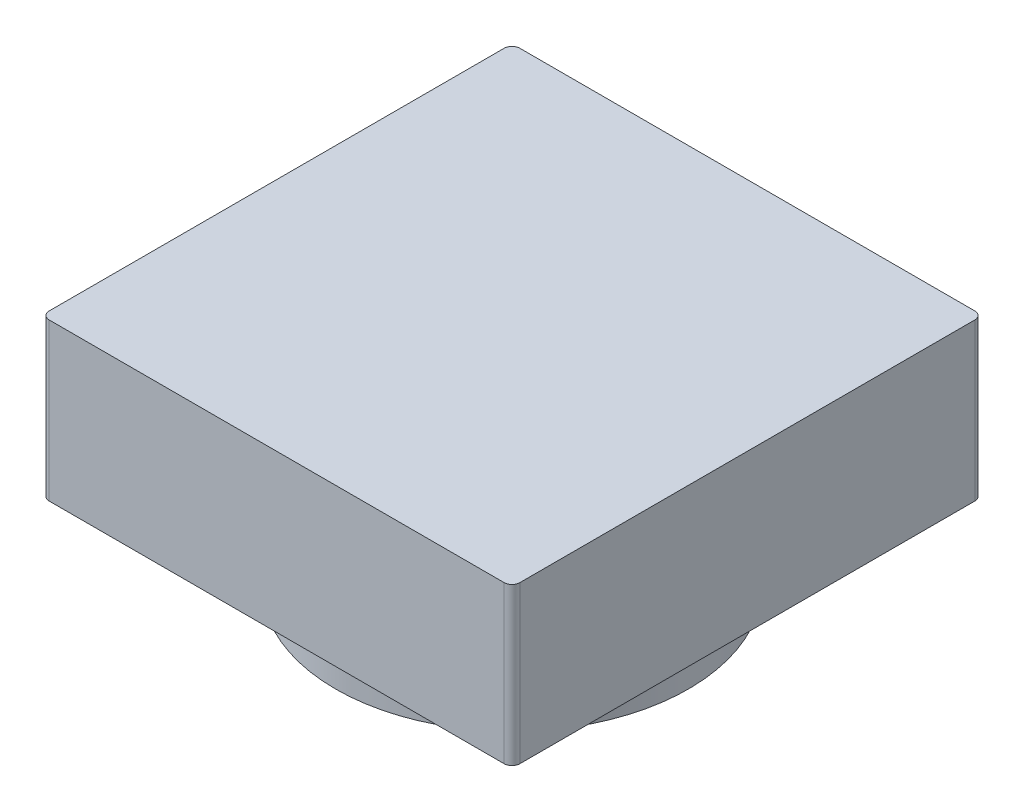
ISO-10303-21;
HEADER;
FILE_DESCRIPTION(('STEP AP214'),'2;1');
FILE_NAME('part.step','',(''),(''),'','','');
FILE_SCHEMA(('AUTOMOTIVE_DESIGN { 1 0 10303 214 1 1 1 1 }'));
ENDSEC;
DATA;
#1=APPLICATION_CONTEXT('core data for automotive mechanical design processes');
#2=APPLICATION_PROTOCOL_DEFINITION('international standard','automotive_design',2000,#1);
#3=PRODUCT_CONTEXT('',#1,'mechanical');
#4=PRODUCT('Part','Part','',(#3));
#5=PRODUCT_RELATED_PRODUCT_CATEGORY('part','',(#4));
#6=PRODUCT_DEFINITION_FORMATION('','',#4);
#7=PRODUCT_DEFINITION_CONTEXT('part definition',#1,'design');
#8=PRODUCT_DEFINITION('design','',#6,#7);
#9=PRODUCT_DEFINITION_SHAPE('','',#8);
#10=(LENGTH_UNIT() NAMED_UNIT(*) SI_UNIT(.MILLI.,.METRE.));
#11=(NAMED_UNIT(*) PLANE_ANGLE_UNIT() SI_UNIT($,.RADIAN.));
#12=(NAMED_UNIT(*) SI_UNIT($,.STERADIAN.) SOLID_ANGLE_UNIT());
#13=UNCERTAINTY_MEASURE_WITH_UNIT(LENGTH_MEASURE(1.E-05),#10,'distance_accuracy_value','');
#14=(GEOMETRIC_REPRESENTATION_CONTEXT(3) GLOBAL_UNCERTAINTY_ASSIGNED_CONTEXT((#13)) GLOBAL_UNIT_ASSIGNED_CONTEXT((#10,
#11,#12)) REPRESENTATION_CONTEXT('',''));
#15=CARTESIAN_POINT('',(0.,0.,0.));
#16=DIRECTION('',(0.,0.,1.));
#17=DIRECTION('',(1.,0.,0.));
#18=AXIS2_PLACEMENT_3D('',#15,#16,#17);
#19=CARTESIAN_POINT('',(0.,10.,0.));
#20=DIRECTION('',(0.,-1.,0.));
#21=DIRECTION('',(0.,0.,-1.));
#22=AXIS2_PLACEMENT_3D('',#19,#20,#21);
#23=CYLINDRICAL_SURFACE('',#22,22.5);
#24=CARTESIAN_POINT('',(0.,10.,0.));
#25=DIRECTION('',(0.,1.,0.));
#26=DIRECTION('',(0.,0.,1.));
#27=AXIS2_PLACEMENT_3D('',#24,#25,#26);
#28=CIRCLE('',#27,22.5);
#29=CARTESIAN_POINT('',(0.,10.,22.5));
#30=VERTEX_POINT('',#29);
#31=EDGE_CURVE('E11',#30,#30,#28,.T.);
#32=ORIENTED_EDGE('',*,*,#31,.F.);
#33=EDGE_LOOP('',(#32));
#34=FACE_BOUND('',#33,.T.);
#35=CARTESIAN_POINT('',(0.,0.,0.));
#36=DIRECTION('',(0.,1.,0.));
#37=DIRECTION('',(0.,0.,1.));
#38=AXIS2_PLACEMENT_3D('',#35,#36,#37);
#39=CIRCLE('',#38,22.5);
#40=CARTESIAN_POINT('',(0.,0.,22.5));
#41=VERTEX_POINT('',#40);
#42=EDGE_CURVE('E42',#41,#41,#39,.T.);
#43=ORIENTED_EDGE('',*,*,#42,.T.);
#44=EDGE_LOOP('',(#43));
#45=FACE_BOUND('',#44,.T.);
#46=ADVANCED_FACE('F39',(#34,#45),#23,.T.);
#47=CARTESIAN_POINT('',(0.,0.,0.));
#48=DIRECTION('',(0.,1.,0.));
#49=DIRECTION('',(0.,0.,1.));
#50=AXIS2_PLACEMENT_3D('',#47,#48,#49);
#51=PLANE('',#50);
#52=CARTESIAN_POINT('',(0.,0.,0.));
#53=DIRECTION('',(0.,-1.,0.));
#54=DIRECTION('',(0.,0.,-1.));
#55=AXIS2_PLACEMENT_3D('',#52,#53,#54);
#56=CIRCLE('',#55,21.5);
#57=CARTESIAN_POINT('',(4.83856503950974,0.,20.9484674465326));
#58=VERTEX_POINT('',#57);
#59=CARTESIAN_POINT('',(-4.83856503950294,0.,20.9484674465341));
#60=VERTEX_POINT('',#59);
#61=EDGE_CURVE('E269',#58,#60,#56,.T.);
#62=ORIENTED_EDGE('',*,*,#61,.F.);
#63=DIRECTION('',(-0.471428571428459,0.,0.881904247660097));
#64=VECTOR('',#63,1.);
#65=CARTESIAN_POINT('',(12.4726457883362,0.,6.66734693877418));
#66=LINE('',#65,#64);
#67=CARTESIAN_POINT('',(14.5514200863916,0.,2.77857142856957));
#68=VERTEX_POINT('',#67);
#69=EDGE_CURVE('E53',#68,#58,#66,.T.);
#70=ORIENTED_EDGE('',*,*,#69,.F.);
#71=CARTESIAN_POINT('',(0.,0.,-5.));
#72=DIRECTION('',(0.,-1.,0.));
#73=DIRECTION('',(0.,0.,-1.));
#74=AXIS2_PLACEMENT_3D('',#71,#72,#73);
#75=CIRCLE('',#74,16.5);
#76=CARTESIAN_POINT('',(-14.5514200863896,0.,2.77857142857328));
#77=VERTEX_POINT('',#76);
#78=EDGE_CURVE('E257',#77,#68,#75,.T.);
#79=ORIENTED_EDGE('',*,*,#78,.F.);
#80=DIRECTION('',(-0.471428571428684,0.,-0.881904247659977));
#81=VECTOR('',#80,1.);
#82=CARTESIAN_POINT('',(-12.4726457883335,0.,6.66734693877684));
#83=LINE('',#82,#81);
#84=EDGE_CURVE('E262',#60,#77,#83,.T.);
#85=ORIENTED_EDGE('',*,*,#84,.F.);
#86=EDGE_LOOP('',(#62,#70,#79,#85));
#87=FACE_BOUND('',#86,.T.);
#88=ORIENTED_EDGE('',*,*,#42,.F.);
#89=EDGE_LOOP('',(#88));
#90=FACE_BOUND('',#89,.T.);
#91=ADVANCED_FACE('F183',(#87,#90),#51,.F.);
#92=CARTESIAN_POINT('',(-29.,30.,29.));
#93=DIRECTION('',(0.,-1.,0.));
#94=DIRECTION('',(0.,0.,-1.));
#95=AXIS2_PLACEMENT_3D('',#92,#93,#94);
#96=CYLINDRICAL_SURFACE('',#95,1.);
#97=CARTESIAN_POINT('',(-29.,10.,29.));
#98=DIRECTION('',(0.,1.,0.));
#99=DIRECTION('',(0.,0.,1.));
#100=AXIS2_PLACEMENT_3D('',#97,#98,#99);
#101=CIRCLE('',#100,1.);
#102=CARTESIAN_POINT('',(-30.,10.,29.));
#103=VERTEX_POINT('',#102);
#104=CARTESIAN_POINT('',(-29.,10.,30.));
#105=VERTEX_POINT('',#104);
#106=EDGE_CURVE('E148',#103,#105,#101,.T.);
#107=ORIENTED_EDGE('',*,*,#106,.T.);
#108=DIRECTION('',(0.,-1.,0.));
#109=VECTOR('',#108,1.);
#110=CARTESIAN_POINT('',(-29.,30.,30.));
#111=LINE('',#110,#109);
#112=CARTESIAN_POINT('',(-29.,30.,30.));
#113=VERTEX_POINT('',#112);
#114=EDGE_CURVE('E177',#113,#105,#111,.T.);
#115=ORIENTED_EDGE('',*,*,#114,.F.);
#116=CARTESIAN_POINT('',(-29.,30.,29.));
#117=DIRECTION('',(0.,1.,0.));
#118=DIRECTION('',(0.,0.,1.));
#119=AXIS2_PLACEMENT_3D('',#116,#117,#118);
#120=CIRCLE('',#119,1.);
#121=CARTESIAN_POINT('',(-30.,30.,29.));
#122=VERTEX_POINT('',#121);
#123=EDGE_CURVE('E164',#122,#113,#120,.T.);
#124=ORIENTED_EDGE('',*,*,#123,.F.);
#125=DIRECTION('',(0.,-1.,0.));
#126=VECTOR('',#125,1.);
#127=CARTESIAN_POINT('',(-30.,30.,29.));
#128=LINE('',#127,#126);
#129=EDGE_CURVE('E144',#122,#103,#128,.T.);
#130=ORIENTED_EDGE('',*,*,#129,.T.);
#131=EDGE_LOOP('',(#107,#115,#124,#130));
#132=FACE_BOUND('',#131,.T.);
#133=ADVANCED_FACE('F185',(#132),#96,.T.);
#134=CARTESIAN_POINT('',(-29.,30.,30.));
#135=DIRECTION('',(0.,0.,-1.));
#136=DIRECTION('',(-1.,0.,0.));
#137=AXIS2_PLACEMENT_3D('',#134,#135,#136);
#138=PLANE('',#137);
#139=DIRECTION('',(1.,0.,0.));
#140=VECTOR('',#139,1.);
#141=CARTESIAN_POINT('',(-29.,10.,30.));
#142=LINE('',#141,#140);
#143=CARTESIAN_POINT('',(29.,10.,30.));
#144=VERTEX_POINT('',#143);
#145=EDGE_CURVE('E151',#105,#144,#142,.T.);
#146=ORIENTED_EDGE('',*,*,#145,.T.);
#147=DIRECTION('',(0.,-1.,0.));
#148=VECTOR('',#147,1.);
#149=CARTESIAN_POINT('',(29.,30.,30.));
#150=LINE('',#149,#148);
#151=CARTESIAN_POINT('',(29.,30.,30.));
#152=VERTEX_POINT('',#151);
#153=EDGE_CURVE('E174',#152,#144,#150,.T.);
#154=ORIENTED_EDGE('',*,*,#153,.F.);
#155=DIRECTION('',(1.,0.,0.));
#156=VECTOR('',#155,1.);
#157=CARTESIAN_POINT('',(-29.,30.,30.));
#158=LINE('',#157,#156);
#159=EDGE_CURVE('E104',#113,#152,#158,.T.);
#160=ORIENTED_EDGE('',*,*,#159,.F.);
#161=ORIENTED_EDGE('',*,*,#114,.T.);
#162=EDGE_LOOP('',(#146,#154,#160,#161));
#163=FACE_BOUND('',#162,.T.);
#164=ADVANCED_FACE('F192',(#163),#138,.F.);
#165=CARTESIAN_POINT('',(29.,30.,29.));
#166=DIRECTION('',(0.,-1.,0.));
#167=DIRECTION('',(0.,0.,-1.));
#168=AXIS2_PLACEMENT_3D('',#165,#166,#167);
#169=CYLINDRICAL_SURFACE('',#168,1.);
#170=CARTESIAN_POINT('',(29.,10.,29.));
#171=DIRECTION('',(0.,1.,0.));
#172=DIRECTION('',(0.,0.,1.));
#173=AXIS2_PLACEMENT_3D('',#170,#171,#172);
#174=CIRCLE('',#173,1.);
#175=CARTESIAN_POINT('',(30.,10.,29.));
#176=VERTEX_POINT('',#175);
#177=EDGE_CURVE('E154',#144,#176,#174,.T.);
#178=ORIENTED_EDGE('',*,*,#177,.T.);
#179=DIRECTION('',(0.,-1.,0.));
#180=VECTOR('',#179,1.);
#181=CARTESIAN_POINT('',(30.,30.,29.));
#182=LINE('',#181,#180);
#183=CARTESIAN_POINT('',(30.,30.,29.));
#184=VERTEX_POINT('',#183);
#185=EDGE_CURVE('E171',#184,#176,#182,.T.);
#186=ORIENTED_EDGE('',*,*,#185,.F.);
#187=CARTESIAN_POINT('',(29.,30.,29.));
#188=DIRECTION('',(0.,1.,0.));
#189=DIRECTION('',(0.,0.,1.));
#190=AXIS2_PLACEMENT_3D('',#187,#188,#189);
#191=CIRCLE('',#190,1.);
#192=EDGE_CURVE('E284',#152,#184,#191,.T.);
#193=ORIENTED_EDGE('',*,*,#192,.F.);
#194=ORIENTED_EDGE('',*,*,#153,.T.);
#195=EDGE_LOOP('',(#178,#186,#193,#194));
#196=FACE_BOUND('',#195,.T.);
#197=ADVANCED_FACE('F201',(#196),#169,.T.);
#198=CARTESIAN_POINT('',(30.,30.,-29.));
#199=DIRECTION('',(-1.,0.,0.));
#200=DIRECTION('',(0.,0.,1.));
#201=AXIS2_PLACEMENT_3D('',#198,#199,#200);
#202=PLANE('',#201);
#203=DIRECTION('',(0.,0.,-1.));
#204=VECTOR('',#203,1.);
#205=CARTESIAN_POINT('',(30.,10.,-29.));
#206=LINE('',#205,#204);
#207=CARTESIAN_POINT('',(30.,10.,-29.));
#208=VERTEX_POINT('',#207);
#209=EDGE_CURVE('E156',#176,#208,#206,.T.);
#210=ORIENTED_EDGE('',*,*,#209,.T.);
#211=DIRECTION('',(0.,-1.,0.));
#212=VECTOR('',#211,1.);
#213=CARTESIAN_POINT('',(30.,30.,-29.));
#214=LINE('',#213,#212);
#215=CARTESIAN_POINT('',(30.,30.,-29.));
#216=VERTEX_POINT('',#215);
#217=EDGE_CURVE('E168',#216,#208,#214,.T.);
#218=ORIENTED_EDGE('',*,*,#217,.F.);
#219=DIRECTION('',(0.,0.,-1.));
#220=VECTOR('',#219,1.);
#221=CARTESIAN_POINT('',(30.,30.,-29.));
#222=LINE('',#221,#220);
#223=EDGE_CURVE('E286',#184,#216,#222,.T.);
#224=ORIENTED_EDGE('',*,*,#223,.F.);
#225=ORIENTED_EDGE('',*,*,#185,.T.);
#226=EDGE_LOOP('',(#210,#218,#224,#225));
#227=FACE_BOUND('',#226,.T.);
#228=ADVANCED_FACE('F204',(#227),#202,.F.);
#229=CARTESIAN_POINT('',(29.,30.,-29.));
#230=DIRECTION('',(0.,-1.,0.));
#231=DIRECTION('',(0.,0.,-1.));
#232=AXIS2_PLACEMENT_3D('',#229,#230,#231);
#233=CYLINDRICAL_SURFACE('',#232,1.);
#234=CARTESIAN_POINT('',(29.,10.,-29.));
#235=DIRECTION('',(0.,1.,0.));
#236=DIRECTION('',(0.,0.,-1.));
#237=AXIS2_PLACEMENT_3D('',#234,#235,#236);
#238=CIRCLE('',#237,1.);
#239=CARTESIAN_POINT('',(29.,10.,-30.));
#240=VERTEX_POINT('',#239);
#241=EDGE_CURVE('E158',#208,#240,#238,.T.);
#242=ORIENTED_EDGE('',*,*,#241,.T.);
#243=DIRECTION('',(0.,-1.,0.));
#244=VECTOR('',#243,1.);
#245=CARTESIAN_POINT('',(29.,30.,-30.));
#246=LINE('',#245,#244);
#247=CARTESIAN_POINT('',(29.,30.,-30.));
#248=VERTEX_POINT('',#247);
#249=EDGE_CURVE('E139',#248,#240,#246,.T.);
#250=ORIENTED_EDGE('',*,*,#249,.F.);
#251=CARTESIAN_POINT('',(29.,30.,-29.));
#252=DIRECTION('',(0.,1.,0.));
#253=DIRECTION('',(0.,0.,-1.));
#254=AXIS2_PLACEMENT_3D('',#251,#252,#253);
#255=CIRCLE('',#254,1.);
#256=EDGE_CURVE('E127',#216,#248,#255,.T.);
#257=ORIENTED_EDGE('',*,*,#256,.F.);
#258=ORIENTED_EDGE('',*,*,#217,.T.);
#259=EDGE_LOOP('',(#242,#250,#257,#258));
#260=FACE_BOUND('',#259,.T.);
#261=ADVANCED_FACE('F208',(#260),#233,.T.);
#262=CARTESIAN_POINT('',(-29.,30.,-30.));
#263=DIRECTION('',(0.,0.,1.));
#264=DIRECTION('',(1.,0.,0.));
#265=AXIS2_PLACEMENT_3D('',#262,#263,#264);
#266=PLANE('',#265);
#267=DIRECTION('',(-1.,0.,0.));
#268=VECTOR('',#267,1.);
#269=CARTESIAN_POINT('',(-29.,10.,-30.));
#270=LINE('',#269,#268);
#271=CARTESIAN_POINT('',(-29.,10.,-30.));
#272=VERTEX_POINT('',#271);
#273=EDGE_CURVE('E136',#240,#272,#270,.T.);
#274=ORIENTED_EDGE('',*,*,#273,.T.);
#275=DIRECTION('',(0.,-1.,0.));
#276=VECTOR('',#275,1.);
#277=CARTESIAN_POINT('',(-29.,30.,-30.));
#278=LINE('',#277,#276);
#279=CARTESIAN_POINT('',(-29.,30.,-30.));
#280=VERTEX_POINT('',#279);
#281=EDGE_CURVE('E133',#280,#272,#278,.T.);
#282=ORIENTED_EDGE('',*,*,#281,.F.);
#283=DIRECTION('',(-1.,0.,0.));
#284=VECTOR('',#283,1.);
#285=CARTESIAN_POINT('',(-29.,30.,-30.));
#286=LINE('',#285,#284);
#287=EDGE_CURVE('E120',#248,#280,#286,.T.);
#288=ORIENTED_EDGE('',*,*,#287,.F.);
#289=ORIENTED_EDGE('',*,*,#249,.T.);
#290=EDGE_LOOP('',(#274,#282,#288,#289));
#291=FACE_BOUND('',#290,.T.);
#292=ADVANCED_FACE('F134',(#291),#266,.F.);
#293=CARTESIAN_POINT('',(-29.,30.,-29.));
#294=DIRECTION('',(0.,-1.,0.));
#295=DIRECTION('',(0.,0.,-1.));
#296=AXIS2_PLACEMENT_3D('',#293,#294,#295);
#297=CYLINDRICAL_SURFACE('',#296,1.);
#298=CARTESIAN_POINT('',(-29.,10.,-29.));
#299=DIRECTION('',(0.,1.,0.));
#300=DIRECTION('',(0.,0.,1.));
#301=AXIS2_PLACEMENT_3D('',#298,#299,#300);
#302=CIRCLE('',#301,1.);
#303=CARTESIAN_POINT('',(-30.,10.,-29.));
#304=VERTEX_POINT('',#303);
#305=EDGE_CURVE('E161',#272,#304,#302,.T.);
#306=ORIENTED_EDGE('',*,*,#305,.T.);
#307=DIRECTION('',(0.,-1.,0.));
#308=VECTOR('',#307,1.);
#309=CARTESIAN_POINT('',(-30.,30.,-29.));
#310=LINE('',#309,#308);
#311=CARTESIAN_POINT('',(-30.,30.,-29.));
#312=VERTEX_POINT('',#311);
#313=EDGE_CURVE('E140',#312,#304,#310,.T.);
#314=ORIENTED_EDGE('',*,*,#313,.F.);
#315=CARTESIAN_POINT('',(-29.,30.,-29.));
#316=DIRECTION('',(0.,1.,0.));
#317=DIRECTION('',(0.,0.,1.));
#318=AXIS2_PLACEMENT_3D('',#315,#316,#317);
#319=CIRCLE('',#318,1.);
#320=EDGE_CURVE('E124',#280,#312,#319,.T.);
#321=ORIENTED_EDGE('',*,*,#320,.F.);
#322=ORIENTED_EDGE('',*,*,#281,.T.);
#323=EDGE_LOOP('',(#306,#314,#321,#322));
#324=FACE_BOUND('',#323,.T.);
#325=ADVANCED_FACE('F142',(#324),#297,.T.);
#326=CARTESIAN_POINT('',(-30.,30.,-29.));
#327=DIRECTION('',(1.,0.,0.));
#328=DIRECTION('',(0.,0.,-1.));
#329=AXIS2_PLACEMENT_3D('',#326,#327,#328);
#330=PLANE('',#329);
#331=DIRECTION('',(0.,0.,1.));
#332=VECTOR('',#331,1.);
#333=CARTESIAN_POINT('',(-30.,10.,-29.));
#334=LINE('',#333,#332);
#335=EDGE_CURVE('E95',#304,#103,#334,.T.);
#336=ORIENTED_EDGE('',*,*,#335,.T.);
#337=ORIENTED_EDGE('',*,*,#129,.F.);
#338=DIRECTION('',(0.,0.,1.));
#339=VECTOR('',#338,1.);
#340=CARTESIAN_POINT('',(-30.,30.,-29.));
#341=LINE('',#340,#339);
#342=EDGE_CURVE('E62',#312,#122,#341,.T.);
#343=ORIENTED_EDGE('',*,*,#342,.F.);
#344=ORIENTED_EDGE('',*,*,#313,.T.);
#345=EDGE_LOOP('',(#336,#337,#343,#344));
#346=FACE_BOUND('',#345,.T.);
#347=ADVANCED_FACE('F217',(#346),#330,.F.);
#348=CARTESIAN_POINT('',(-29.,30.,29.));
#349=DIRECTION('',(0.,1.,0.));
#350=DIRECTION('',(0.,0.,1.));
#351=AXIS2_PLACEMENT_3D('',#348,#349,#350);
#352=PLANE('',#351);
#353=ORIENTED_EDGE('',*,*,#123,.T.);
#354=ORIENTED_EDGE('',*,*,#159,.T.);
#355=ORIENTED_EDGE('',*,*,#192,.T.);
#356=ORIENTED_EDGE('',*,*,#223,.T.);
#357=ORIENTED_EDGE('',*,*,#256,.T.);
#358=ORIENTED_EDGE('',*,*,#287,.T.);
#359=ORIENTED_EDGE('',*,*,#320,.T.);
#360=ORIENTED_EDGE('',*,*,#342,.T.);
#361=EDGE_LOOP('',(#353,#354,#355,#356,#357,#358,#359,#360));
#362=FACE_BOUND('',#361,.T.);
#363=ADVANCED_FACE('F122',(#362),#352,.T.);
#364=CARTESIAN_POINT('',(-29.,10.,29.));
#365=DIRECTION('',(0.,1.,0.));
#366=DIRECTION('',(0.,0.,1.));
#367=AXIS2_PLACEMENT_3D('',#364,#365,#366);
#368=PLANE('',#367);
#369=ORIENTED_EDGE('',*,*,#31,.T.);
#370=EDGE_LOOP('',(#369));
#371=FACE_BOUND('',#370,.T.);
#372=ORIENTED_EDGE('',*,*,#106,.F.);
#373=ORIENTED_EDGE('',*,*,#335,.F.);
#374=ORIENTED_EDGE('',*,*,#305,.F.);
#375=ORIENTED_EDGE('',*,*,#273,.F.);
#376=ORIENTED_EDGE('',*,*,#241,.F.);
#377=ORIENTED_EDGE('',*,*,#209,.F.);
#378=ORIENTED_EDGE('',*,*,#177,.F.);
#379=ORIENTED_EDGE('',*,*,#145,.F.);
#380=EDGE_LOOP('',(#372,#373,#374,#375,#376,#377,#378,#379));
#381=FACE_BOUND('',#380,.T.);
#382=ADVANCED_FACE('F220',(#371,#381),#368,.F.);
#383=CARTESIAN_POINT('',(12.4726457883362,5.,6.66734693877418));
#384=DIRECTION('',(0.881904247660097,0.,0.471428571428459));
#385=DIRECTION('',(0.471428571428459,0.,-0.881904247660097));
#386=AXIS2_PLACEMENT_3D('',#383,#384,#385);
#387=PLANE('',#386);
#388=ORIENTED_EDGE('',*,*,#69,.T.);
#389=DIRECTION('',(0.,-1.,0.));
#390=VECTOR('',#389,1.);
#391=CARTESIAN_POINT('',(4.83856503950974,5.,20.9484674465326));
#392=LINE('',#391,#390);
#393=CARTESIAN_POINT('',(4.83856503950974,5.,20.9484674465326));
#394=VERTEX_POINT('',#393);
#395=EDGE_CURVE('E267',#394,#58,#392,.T.);
#396=ORIENTED_EDGE('',*,*,#395,.F.);
#397=DIRECTION('',(-0.471428571428459,0.,0.881904247660097));
#398=VECTOR('',#397,1.);
#399=CARTESIAN_POINT('',(12.4726457883362,5.,6.66734693877418));
#400=LINE('',#399,#398);
#401=CARTESIAN_POINT('',(14.5514200863916,5.,2.77857142856957));
#402=VERTEX_POINT('',#401);
#403=EDGE_CURVE('E249',#402,#394,#400,.T.);
#404=ORIENTED_EDGE('',*,*,#403,.F.);
#405=DIRECTION('',(0.,-1.,0.));
#406=VECTOR('',#405,1.);
#407=CARTESIAN_POINT('',(14.5514200863916,5.,2.77857142856957));
#408=LINE('',#407,#406);
#409=EDGE_CURVE('E152',#402,#68,#408,.T.);
#410=ORIENTED_EDGE('',*,*,#409,.T.);
#411=EDGE_LOOP('',(#388,#396,#404,#410));
#412=FACE_BOUND('',#411,.T.);
#413=ADVANCED_FACE('F222',(#412),#387,.F.);
#414=CARTESIAN_POINT('',(0.,5.,-5.));
#415=DIRECTION('',(0.,-1.,0.));
#416=DIRECTION('',(0.,0.,-1.));
#417=AXIS2_PLACEMENT_3D('',#414,#415,#416);
#418=CYLINDRICAL_SURFACE('',#417,16.5);
#419=ORIENTED_EDGE('',*,*,#78,.T.);
#420=ORIENTED_EDGE('',*,*,#409,.F.);
#421=CARTESIAN_POINT('',(0.,5.,-5.));
#422=DIRECTION('',(0.,-1.,0.));
#423=DIRECTION('',(0.,0.,-1.));
#424=AXIS2_PLACEMENT_3D('',#421,#422,#423);
#425=CIRCLE('',#424,16.5);
#426=CARTESIAN_POINT('',(-14.5514200863896,5.,2.77857142857328));
#427=VERTEX_POINT('',#426);
#428=EDGE_CURVE('E255',#427,#402,#425,.T.);
#429=ORIENTED_EDGE('',*,*,#428,.F.);
#430=DIRECTION('',(0.,-1.,0.));
#431=VECTOR('',#430,1.);
#432=CARTESIAN_POINT('',(-14.5514200863896,5.,2.77857142857328));
#433=LINE('',#432,#431);
#434=EDGE_CURVE('E275',#427,#77,#433,.T.);
#435=ORIENTED_EDGE('',*,*,#434,.T.);
#436=EDGE_LOOP('',(#419,#420,#429,#435));
#437=FACE_BOUND('',#436,.T.);
#438=ADVANCED_FACE('F227',(#437),#418,.F.);
#439=CARTESIAN_POINT('',(-12.4726457883335,5.,6.66734693877684));
#440=DIRECTION('',(-0.881904247659977,0.,0.471428571428684));
#441=DIRECTION('',(0.471428571428684,0.,0.881904247659977));
#442=AXIS2_PLACEMENT_3D('',#439,#440,#441);
#443=PLANE('',#442);
#444=ORIENTED_EDGE('',*,*,#84,.T.);
#445=ORIENTED_EDGE('',*,*,#434,.F.);
#446=DIRECTION('',(-0.471428571428684,0.,-0.881904247659977));
#447=VECTOR('',#446,1.);
#448=CARTESIAN_POINT('',(-12.4726457883335,5.,6.66734693877684));
#449=LINE('',#448,#447);
#450=CARTESIAN_POINT('',(-4.83856503950294,5.,20.9484674465341));
#451=VERTEX_POINT('',#450);
#452=EDGE_CURVE('E259',#451,#427,#449,.T.);
#453=ORIENTED_EDGE('',*,*,#452,.F.);
#454=DIRECTION('',(0.,-1.,0.));
#455=VECTOR('',#454,1.);
#456=CARTESIAN_POINT('',(-4.83856503950294,5.,20.9484674465341));
#457=LINE('',#456,#455);
#458=EDGE_CURVE('E278',#451,#60,#457,.T.);
#459=ORIENTED_EDGE('',*,*,#458,.T.);
#460=EDGE_LOOP('',(#444,#445,#453,#459));
#461=FACE_BOUND('',#460,.T.);
#462=ADVANCED_FACE('F232',(#461),#443,.F.);
#463=CARTESIAN_POINT('',(0.,5.,0.));
#464=DIRECTION('',(0.,-1.,0.));
#465=DIRECTION('',(0.,0.,-1.));
#466=AXIS2_PLACEMENT_3D('',#463,#464,#465);
#467=CYLINDRICAL_SURFACE('',#466,21.5);
#468=ORIENTED_EDGE('',*,*,#61,.T.);
#469=ORIENTED_EDGE('',*,*,#458,.F.);
#470=CARTESIAN_POINT('',(0.,5.,0.));
#471=DIRECTION('',(0.,-1.,0.));
#472=DIRECTION('',(0.,0.,-1.));
#473=AXIS2_PLACEMENT_3D('',#470,#471,#472);
#474=CIRCLE('',#473,21.5);
#475=EDGE_CURVE('E253',#394,#451,#474,.T.);
#476=ORIENTED_EDGE('',*,*,#475,.F.);
#477=ORIENTED_EDGE('',*,*,#395,.T.);
#478=EDGE_LOOP('',(#468,#469,#476,#477));
#479=FACE_BOUND('',#478,.T.);
#480=ADVANCED_FACE('F228',(#479),#467,.F.);
#481=CARTESIAN_POINT('',(0.,5.,0.));
#482=DIRECTION('',(0.,-1.,0.));
#483=DIRECTION('',(0.,0.,-1.));
#484=AXIS2_PLACEMENT_3D('',#481,#482,#483);
#485=PLANE('',#484);
#486=ORIENTED_EDGE('',*,*,#403,.T.);
#487=ORIENTED_EDGE('',*,*,#475,.T.);
#488=ORIENTED_EDGE('',*,*,#452,.T.);
#489=ORIENTED_EDGE('',*,*,#428,.T.);
#490=EDGE_LOOP('',(#486,#487,#488,#489));
#491=FACE_BOUND('',#490,.T.);
#492=ADVANCED_FACE('F231',(#491),#485,.T.);
#493=CLOSED_SHELL('',(#46,#91,#133,#164,#197,#228,#261,#292,#325,#347,#363,#382,#413,#438,#462,
#480,#492));
#494=MANIFOLD_SOLID_BREP('B2',#493);
#495=ADVANCED_BREP_SHAPE_REPRESENTATION('',(#18,#494),#14);
#496=SHAPE_DEFINITION_REPRESENTATION(#9,#495);
ENDSEC;
END-ISO-10303-21;
